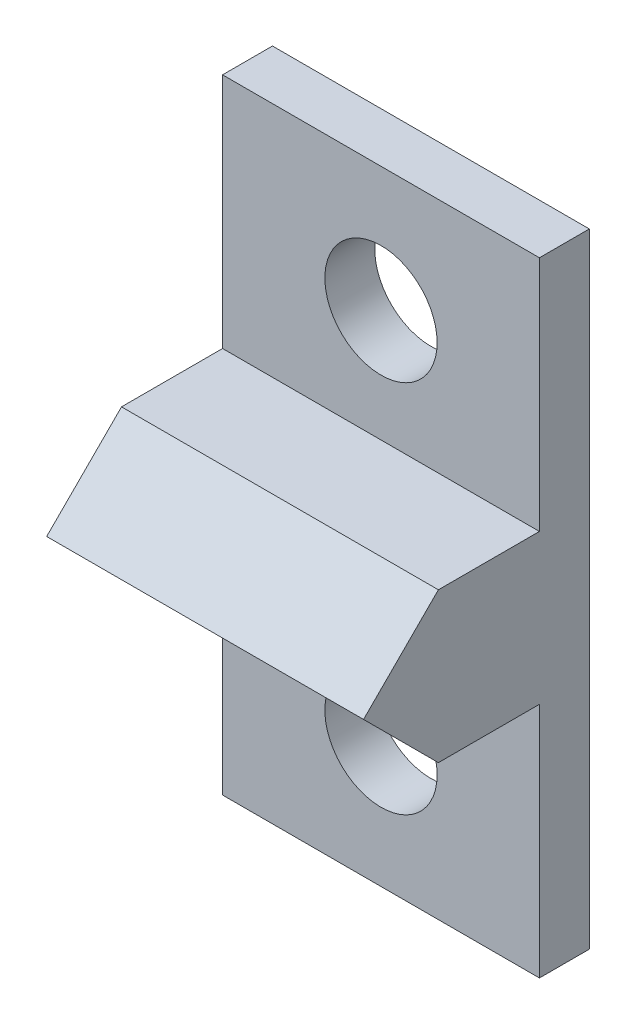
ISO-10303-21;
HEADER;
FILE_DESCRIPTION(('STEP AP214'),'2;1');
FILE_NAME('part.step','',(''),(''),'','','');
FILE_SCHEMA(('AUTOMOTIVE_DESIGN { 1 0 10303 214 1 1 1 1 }'));
ENDSEC;
DATA;
#1=APPLICATION_CONTEXT('core data for automotive mechanical design processes');
#2=APPLICATION_PROTOCOL_DEFINITION('international standard','automotive_design',2000,#1);
#3=PRODUCT_CONTEXT('',#1,'mechanical');
#4=PRODUCT('Part','Part','',(#3));
#5=PRODUCT_RELATED_PRODUCT_CATEGORY('part','',(#4));
#6=PRODUCT_DEFINITION_FORMATION('','',#4);
#7=PRODUCT_DEFINITION_CONTEXT('part definition',#1,'design');
#8=PRODUCT_DEFINITION('design','',#6,#7);
#9=PRODUCT_DEFINITION_SHAPE('','',#8);
#10=(LENGTH_UNIT() NAMED_UNIT(*) SI_UNIT(.MILLI.,.METRE.));
#11=(NAMED_UNIT(*) PLANE_ANGLE_UNIT() SI_UNIT($,.RADIAN.));
#12=(NAMED_UNIT(*) SI_UNIT($,.STERADIAN.) SOLID_ANGLE_UNIT());
#13=UNCERTAINTY_MEASURE_WITH_UNIT(LENGTH_MEASURE(1.E-05),#10,'distance_accuracy_value','');
#14=(GEOMETRIC_REPRESENTATION_CONTEXT(3) GLOBAL_UNCERTAINTY_ASSIGNED_CONTEXT((#13)) GLOBAL_UNIT_ASSIGNED_CONTEXT((#10,
#11,#12)) REPRESENTATION_CONTEXT('',''));
#15=CARTESIAN_POINT('',(0.,0.,0.));
#16=DIRECTION('',(0.,0.,1.));
#17=DIRECTION('',(1.,0.,0.));
#18=AXIS2_PLACEMENT_3D('',#15,#16,#17);
#19=CARTESIAN_POINT('',(0.,0.,2.));
#20=DIRECTION('',(0.,0.,1.));
#21=DIRECTION('',(1.,0.,0.));
#22=AXIS2_PLACEMENT_3D('',#19,#20,#21);
#23=PLANE('',#22);
#24=DIRECTION('',(-1.,0.,0.));
#25=VECTOR('',#24,1.);
#26=CARTESIAN_POINT('',(-6.35,15.5,2.));
#27=LINE('',#26,#25);
#28=CARTESIAN_POINT('',(6.35,15.5,2.));
#29=VERTEX_POINT('',#28);
#30=CARTESIAN_POINT('',(-6.35,15.5,2.));
#31=VERTEX_POINT('',#30);
#32=EDGE_CURVE('E148',#29,#31,#27,.T.);
#33=ORIENTED_EDGE('',*,*,#32,.F.);
#34=DIRECTION('',(0.,1.,0.));
#35=VECTOR('',#34,1.);
#36=CARTESIAN_POINT('',(6.35,0.,2.));
#37=LINE('',#36,#35);
#38=CARTESIAN_POINT('',(6.35,25.,2.));
#39=VERTEX_POINT('',#38);
#40=EDGE_CURVE('E144',#29,#39,#37,.T.);
#41=ORIENTED_EDGE('',*,*,#40,.T.);
#42=DIRECTION('',(1.,0.,0.));
#43=VECTOR('',#42,1.);
#44=CARTESIAN_POINT('',(0.,25.,2.));
#45=LINE('',#44,#43);
#46=CARTESIAN_POINT('',(-6.35,25.,2.));
#47=VERTEX_POINT('',#46);
#48=EDGE_CURVE('E143',#47,#39,#45,.T.);
#49=ORIENTED_EDGE('',*,*,#48,.F.);
#50=DIRECTION('',(0.,1.,0.));
#51=VECTOR('',#50,1.);
#52=CARTESIAN_POINT('',(-6.35,0.,2.));
#53=LINE('',#52,#51);
#54=EDGE_CURVE('E178',#31,#47,#53,.T.);
#55=ORIENTED_EDGE('',*,*,#54,.F.);
#56=EDGE_LOOP('',(#33,#41,#49,#55));
#57=FACE_BOUND('',#56,.T.);
#58=CARTESIAN_POINT('',(0.,20.,2.));
#59=DIRECTION('',(0.,0.,1.));
#60=DIRECTION('',(1.,0.,0.));
#61=AXIS2_PLACEMENT_3D('',#58,#59,#60);
#62=CIRCLE('',#61,2.25);
#63=CARTESIAN_POINT('',(2.25,20.,2.));
#64=VERTEX_POINT('',#63);
#65=EDGE_CURVE('E168',#64,#64,#62,.T.);
#66=ORIENTED_EDGE('',*,*,#65,.F.);
#67=EDGE_LOOP('',(#66));
#68=FACE_BOUND('',#67,.T.);
#69=ADVANCED_FACE('F47',(#57,#68),#23,.T.);
#70=CARTESIAN_POINT('',(0.,0.,2.));
#71=DIRECTION('',(0.,1.,0.));
#72=DIRECTION('',(0.,0.,1.));
#73=AXIS2_PLACEMENT_3D('',#70,#71,#72);
#74=PLANE('',#73);
#75=DIRECTION('',(1.,0.,0.));
#76=VECTOR('',#75,1.);
#77=CARTESIAN_POINT('',(0.,0.,0.));
#78=LINE('',#77,#76);
#79=CARTESIAN_POINT('',(-6.35,0.,0.));
#80=VERTEX_POINT('',#79);
#81=CARTESIAN_POINT('',(6.35,0.,0.));
#82=VERTEX_POINT('',#81);
#83=EDGE_CURVE('E190',#80,#82,#78,.T.);
#84=ORIENTED_EDGE('',*,*,#83,.T.);
#85=DIRECTION('',(0.,0.,-1.));
#86=VECTOR('',#85,1.);
#87=CARTESIAN_POINT('',(6.35,0.,2.));
#88=LINE('',#87,#86);
#89=CARTESIAN_POINT('',(6.35,0.,2.));
#90=VERTEX_POINT('',#89);
#91=EDGE_CURVE('E213',#90,#82,#88,.T.);
#92=ORIENTED_EDGE('',*,*,#91,.F.);
#93=DIRECTION('',(1.,0.,0.));
#94=VECTOR('',#93,1.);
#95=CARTESIAN_POINT('',(0.,0.,2.));
#96=LINE('',#95,#94);
#97=CARTESIAN_POINT('',(-6.35,0.,2.));
#98=VERTEX_POINT('',#97);
#99=EDGE_CURVE('E140',#98,#90,#96,.T.);
#100=ORIENTED_EDGE('',*,*,#99,.F.);
#101=DIRECTION('',(0.,0.,-1.));
#102=VECTOR('',#101,1.);
#103=CARTESIAN_POINT('',(-6.35,0.,2.));
#104=LINE('',#103,#102);
#105=EDGE_CURVE('E182',#98,#80,#104,.T.);
#106=ORIENTED_EDGE('',*,*,#105,.T.);
#107=EDGE_LOOP('',(#84,#92,#100,#106));
#108=FACE_BOUND('',#107,.T.);
#109=ADVANCED_FACE('F253',(#108),#74,.F.);
#110=CARTESIAN_POINT('',(6.35,0.,2.));
#111=DIRECTION('',(-1.,0.,0.));
#112=DIRECTION('',(0.,0.,1.));
#113=AXIS2_PLACEMENT_3D('',#110,#111,#112);
#114=PLANE('',#113);
#115=DIRECTION('',(0.,0.707106781186546,-0.707106781186549));
#116=VECTOR('',#115,1.);
#117=CARTESIAN_POINT('',(6.35,12.5,9.05));
#118=LINE('',#117,#116);
#119=CARTESIAN_POINT('',(6.35,15.5,6.04999999999998));
#120=VERTEX_POINT('',#119);
#121=CARTESIAN_POINT('',(6.35,12.5,9.05));
#122=VERTEX_POINT('',#121);
#123=EDGE_CURVE('E216',#120,#122,#118,.F.);
#124=ORIENTED_EDGE('',*,*,#123,.T.);
#125=DIRECTION('',(0.,0.707106781186546,0.707106781186549));
#126=VECTOR('',#125,1.);
#127=CARTESIAN_POINT('',(6.35,12.5,9.05));
#128=LINE('',#127,#126);
#129=CARTESIAN_POINT('',(6.35,9.5,6.04999999999999));
#130=VERTEX_POINT('',#129);
#131=EDGE_CURVE('E123',#122,#130,#128,.F.);
#132=ORIENTED_EDGE('',*,*,#131,.T.);
#133=DIRECTION('',(0.,0.,-1.));
#134=VECTOR('',#133,1.);
#135=CARTESIAN_POINT('',(6.35,9.5,9.05));
#136=LINE('',#135,#134);
#137=CARTESIAN_POINT('',(6.35,9.5,2.));
#138=VERTEX_POINT('',#137);
#139=EDGE_CURVE('E116',#130,#138,#136,.T.);
#140=ORIENTED_EDGE('',*,*,#139,.T.);
#141=EDGE_CURVE('E120',#90,#138,#37,.T.);
#142=ORIENTED_EDGE('',*,*,#141,.F.);
#143=ORIENTED_EDGE('',*,*,#91,.T.);
#144=DIRECTION('',(0.,1.,0.));
#145=VECTOR('',#144,1.);
#146=CARTESIAN_POINT('',(6.35,0.,0.));
#147=LINE('',#146,#145);
#148=CARTESIAN_POINT('',(6.35,25.,0.));
#149=VERTEX_POINT('',#148);
#150=EDGE_CURVE('E194',#82,#149,#147,.T.);
#151=ORIENTED_EDGE('',*,*,#150,.T.);
#152=DIRECTION('',(0.,0.,-1.));
#153=VECTOR('',#152,1.);
#154=CARTESIAN_POINT('',(6.35,25.,2.));
#155=LINE('',#154,#153);
#156=EDGE_CURVE('E210',#39,#149,#155,.T.);
#157=ORIENTED_EDGE('',*,*,#156,.F.);
#158=ORIENTED_EDGE('',*,*,#40,.F.);
#159=DIRECTION('',(0.,0.,-1.));
#160=VECTOR('',#159,1.);
#161=CARTESIAN_POINT('',(6.35,15.5,9.05));
#162=LINE('',#161,#160);
#163=EDGE_CURVE('E130',#120,#29,#162,.T.);
#164=ORIENTED_EDGE('',*,*,#163,.F.);
#165=EDGE_LOOP('',(#124,#132,#140,#142,#143,#151,#157,#158,#164));
#166=FACE_BOUND('',#165,.T.);
#167=ADVANCED_FACE('F118',(#166),#114,.F.);
#168=CARTESIAN_POINT('',(0.,25.,2.));
#169=DIRECTION('',(0.,1.,0.));
#170=DIRECTION('',(0.,0.,1.));
#171=AXIS2_PLACEMENT_3D('',#168,#169,#170);
#172=PLANE('',#171);
#173=DIRECTION('',(1.,0.,0.));
#174=VECTOR('',#173,1.);
#175=CARTESIAN_POINT('',(0.,25.,0.));
#176=LINE('',#175,#174);
#177=CARTESIAN_POINT('',(-6.35,25.,0.));
#178=VERTEX_POINT('',#177);
#179=EDGE_CURVE('E198',#178,#149,#176,.T.);
#180=ORIENTED_EDGE('',*,*,#179,.F.);
#181=DIRECTION('',(0.,0.,-1.));
#182=VECTOR('',#181,1.);
#183=CARTESIAN_POINT('',(-6.35,25.,2.));
#184=LINE('',#183,#182);
#185=EDGE_CURVE('E207',#47,#178,#184,.T.);
#186=ORIENTED_EDGE('',*,*,#185,.F.);
#187=ORIENTED_EDGE('',*,*,#48,.T.);
#188=ORIENTED_EDGE('',*,*,#156,.T.);
#189=EDGE_LOOP('',(#180,#186,#187,#188));
#190=FACE_BOUND('',#189,.T.);
#191=ADVANCED_FACE('F240',(#190),#172,.T.);
#192=CARTESIAN_POINT('',(0.,20.,2.));
#193=DIRECTION('',(0.,0.,-1.));
#194=DIRECTION('',(-1.,0.,0.));
#195=AXIS2_PLACEMENT_3D('',#192,#193,#194);
#196=CYLINDRICAL_SURFACE('',#195,2.25);
#197=ORIENTED_EDGE('',*,*,#65,.T.);
#198=EDGE_LOOP('',(#197));
#199=FACE_BOUND('',#198,.T.);
#200=CARTESIAN_POINT('',(0.,20.,0.));
#201=DIRECTION('',(0.,0.,1.));
#202=DIRECTION('',(1.,0.,0.));
#203=AXIS2_PLACEMENT_3D('',#200,#201,#202);
#204=CIRCLE('',#203,2.25);
#205=CARTESIAN_POINT('',(2.25,20.,0.));
#206=VERTEX_POINT('',#205);
#207=EDGE_CURVE('E186',#206,#206,#204,.T.);
#208=ORIENTED_EDGE('',*,*,#207,.F.);
#209=EDGE_LOOP('',(#208));
#210=FACE_BOUND('',#209,.T.);
#211=ADVANCED_FACE('F289',(#199,#210),#196,.F.);
#212=CARTESIAN_POINT('',(0.,5.,2.));
#213=DIRECTION('',(0.,0.,-1.));
#214=DIRECTION('',(-1.,0.,0.));
#215=AXIS2_PLACEMENT_3D('',#212,#213,#214);
#216=CYLINDRICAL_SURFACE('',#215,2.25);
#217=CARTESIAN_POINT('',(0.,5.,2.));
#218=DIRECTION('',(0.,0.,1.));
#219=DIRECTION('',(1.,0.,0.));
#220=AXIS2_PLACEMENT_3D('',#217,#218,#219);
#221=CIRCLE('',#220,2.25);
#222=CARTESIAN_POINT('',(2.25,5.,2.));
#223=VERTEX_POINT('',#222);
#224=EDGE_CURVE('E164',#223,#223,#221,.T.);
#225=ORIENTED_EDGE('',*,*,#224,.T.);
#226=EDGE_LOOP('',(#225));
#227=FACE_BOUND('',#226,.T.);
#228=CARTESIAN_POINT('',(0.,5.,0.));
#229=DIRECTION('',(0.,0.,1.));
#230=DIRECTION('',(1.,0.,0.));
#231=AXIS2_PLACEMENT_3D('',#228,#229,#230);
#232=CIRCLE('',#231,2.25);
#233=CARTESIAN_POINT('',(2.25,5.,0.));
#234=VERTEX_POINT('',#233);
#235=EDGE_CURVE('E163',#234,#234,#232,.T.);
#236=ORIENTED_EDGE('',*,*,#235,.F.);
#237=EDGE_LOOP('',(#236));
#238=FACE_BOUND('',#237,.T.);
#239=ADVANCED_FACE('F287',(#227,#238),#216,.F.);
#240=CARTESIAN_POINT('',(-6.35,0.,2.));
#241=DIRECTION('',(-1.,0.,0.));
#242=DIRECTION('',(0.,0.,1.));
#243=AXIS2_PLACEMENT_3D('',#240,#241,#242);
#244=PLANE('',#243);
#245=DIRECTION('',(0.,0.,-1.));
#246=VECTOR('',#245,1.);
#247=CARTESIAN_POINT('',(-6.35,9.5,9.05));
#248=LINE('',#247,#246);
#249=CARTESIAN_POINT('',(-6.35,9.5,6.04999999999999));
#250=VERTEX_POINT('',#249);
#251=CARTESIAN_POINT('',(-6.35,9.5,2.));
#252=VERTEX_POINT('',#251);
#253=EDGE_CURVE('E129',#250,#252,#248,.T.);
#254=ORIENTED_EDGE('',*,*,#253,.F.);
#255=DIRECTION('',(0.,-0.707106781186546,-0.707106781186549));
#256=VECTOR('',#255,1.);
#257=CARTESIAN_POINT('',(-6.35,2.72500000000002,-0.725000000000014));
#258=LINE('',#257,#256);
#259=CARTESIAN_POINT('',(-6.35,12.5,9.05));
#260=VERTEX_POINT('',#259);
#261=EDGE_CURVE('E58',#250,#260,#258,.F.);
#262=ORIENTED_EDGE('',*,*,#261,.T.);
#263=DIRECTION('',(0.,-0.707106781186546,0.707106781186549));
#264=VECTOR('',#263,1.);
#265=CARTESIAN_POINT('',(-6.35,9.77500000000002,11.775));
#266=LINE('',#265,#264);
#267=CARTESIAN_POINT('',(-6.35,15.5,6.04999999999998));
#268=VERTEX_POINT('',#267);
#269=EDGE_CURVE('E65',#260,#268,#266,.F.);
#270=ORIENTED_EDGE('',*,*,#269,.T.);
#271=DIRECTION('',(0.,0.,-1.));
#272=VECTOR('',#271,1.);
#273=CARTESIAN_POINT('',(-6.35,15.5,9.05));
#274=LINE('',#273,#272);
#275=EDGE_CURVE('E153',#268,#31,#274,.T.);
#276=ORIENTED_EDGE('',*,*,#275,.T.);
#277=ORIENTED_EDGE('',*,*,#54,.T.);
#278=ORIENTED_EDGE('',*,*,#185,.T.);
#279=DIRECTION('',(0.,1.,0.));
#280=VECTOR('',#279,1.);
#281=CARTESIAN_POINT('',(-6.35,0.,0.));
#282=LINE('',#281,#280);
#283=EDGE_CURVE('E169',#80,#178,#282,.T.);
#284=ORIENTED_EDGE('',*,*,#283,.F.);
#285=ORIENTED_EDGE('',*,*,#105,.F.);
#286=EDGE_CURVE('E179',#98,#252,#53,.T.);
#287=ORIENTED_EDGE('',*,*,#286,.T.);
#288=EDGE_LOOP('',(#254,#262,#270,#276,#277,#278,#284,#285,#287));
#289=FACE_BOUND('',#288,.T.);
#290=ADVANCED_FACE('F242',(#289),#244,.T.);
#291=DIRECTION('',(1.,0.,0.));
#292=VECTOR('',#291,1.);
#293=CARTESIAN_POINT('',(-6.35,9.5,2.));
#294=LINE('',#293,#292);
#295=EDGE_CURVE('E137',#252,#138,#294,.T.);
#296=ORIENTED_EDGE('',*,*,#295,.F.);
#297=ORIENTED_EDGE('',*,*,#286,.F.);
#298=ORIENTED_EDGE('',*,*,#99,.T.);
#299=ORIENTED_EDGE('',*,*,#141,.T.);
#300=EDGE_LOOP('',(#296,#297,#298,#299));
#301=FACE_BOUND('',#300,.T.);
#302=ORIENTED_EDGE('',*,*,#224,.F.);
#303=EDGE_LOOP('',(#302));
#304=FACE_BOUND('',#303,.T.);
#305=ADVANCED_FACE('F134',(#301,#304),#23,.T.);
#306=CARTESIAN_POINT('',(0.,0.,0.));
#307=DIRECTION('',(0.,0.,1.));
#308=DIRECTION('',(1.,0.,0.));
#309=AXIS2_PLACEMENT_3D('',#306,#307,#308);
#310=PLANE('',#309);
#311=ORIENTED_EDGE('',*,*,#235,.T.);
#312=EDGE_LOOP('',(#311));
#313=FACE_BOUND('',#312,.T.);
#314=ORIENTED_EDGE('',*,*,#207,.T.);
#315=EDGE_LOOP('',(#314));
#316=FACE_BOUND('',#315,.T.);
#317=ORIENTED_EDGE('',*,*,#83,.F.);
#318=ORIENTED_EDGE('',*,*,#283,.T.);
#319=ORIENTED_EDGE('',*,*,#179,.T.);
#320=ORIENTED_EDGE('',*,*,#150,.F.);
#321=EDGE_LOOP('',(#317,#318,#319,#320));
#322=FACE_BOUND('',#321,.T.);
#323=ADVANCED_FACE('F255',(#313,#316,#322),#310,.F.);
#324=CARTESIAN_POINT('',(-6.35,9.5,9.05));
#325=DIRECTION('',(0.,1.,0.));
#326=DIRECTION('',(0.,0.,1.));
#327=AXIS2_PLACEMENT_3D('',#324,#325,#326);
#328=PLANE('',#327);
#329=ORIENTED_EDGE('',*,*,#139,.F.);
#330=DIRECTION('',(-1.,0.,0.));
#331=VECTOR('',#330,1.);
#332=CARTESIAN_POINT('',(-6.35,9.5,6.04999999999999));
#333=LINE('',#332,#331);
#334=EDGE_CURVE('E221',#130,#250,#333,.T.);
#335=ORIENTED_EDGE('',*,*,#334,.T.);
#336=ORIENTED_EDGE('',*,*,#253,.T.);
#337=ORIENTED_EDGE('',*,*,#295,.T.);
#338=EDGE_LOOP('',(#329,#335,#336,#337));
#339=FACE_BOUND('',#338,.T.);
#340=ADVANCED_FACE('F146',(#339),#328,.F.);
#341=CARTESIAN_POINT('',(-6.35,15.5,9.05));
#342=DIRECTION('',(0.,-1.,0.));
#343=DIRECTION('',(0.,0.,-1.));
#344=AXIS2_PLACEMENT_3D('',#341,#342,#343);
#345=PLANE('',#344);
#346=ORIENTED_EDGE('',*,*,#275,.F.);
#347=DIRECTION('',(1.,0.,0.));
#348=VECTOR('',#347,1.);
#349=CARTESIAN_POINT('',(-6.35,15.5,6.04999999999998));
#350=LINE('',#349,#348);
#351=EDGE_CURVE('E11',#268,#120,#350,.T.);
#352=ORIENTED_EDGE('',*,*,#351,.T.);
#353=ORIENTED_EDGE('',*,*,#163,.T.);
#354=ORIENTED_EDGE('',*,*,#32,.T.);
#355=EDGE_LOOP('',(#346,#352,#353,#354));
#356=FACE_BOUND('',#355,.T.);
#357=ADVANCED_FACE('F244',(#356),#345,.F.);
#358=CARTESIAN_POINT('',(0.,12.5,9.05));
#359=DIRECTION('',(0.,-0.707106781186549,-0.707106781186546));
#360=DIRECTION('',(-1.,0.,0.));
#361=AXIS2_PLACEMENT_3D('',#358,#359,#360);
#362=PLANE('',#361);
#363=ORIENTED_EDGE('',*,*,#351,.F.);
#364=ORIENTED_EDGE('',*,*,#269,.F.);
#365=DIRECTION('',(-1.,0.,0.));
#366=VECTOR('',#365,1.);
#367=CARTESIAN_POINT('',(0.,12.5,9.05));
#368=LINE('',#367,#366);
#369=EDGE_CURVE('E52',#122,#260,#368,.T.);
#370=ORIENTED_EDGE('',*,*,#369,.F.);
#371=ORIENTED_EDGE('',*,*,#123,.F.);
#372=EDGE_LOOP('',(#363,#364,#370,#371));
#373=FACE_BOUND('',#372,.T.);
#374=ADVANCED_FACE('F50',(#373),#362,.F.);
#375=CARTESIAN_POINT('',(0.,12.5,9.05));
#376=DIRECTION('',(0.,0.707106781186549,-0.707106781186546));
#377=DIRECTION('',(1.,0.,0.));
#378=AXIS2_PLACEMENT_3D('',#375,#376,#377);
#379=PLANE('',#378);
#380=ORIENTED_EDGE('',*,*,#261,.F.);
#381=ORIENTED_EDGE('',*,*,#334,.F.);
#382=ORIENTED_EDGE('',*,*,#131,.F.);
#383=ORIENTED_EDGE('',*,*,#369,.T.);
#384=EDGE_LOOP('',(#380,#381,#382,#383));
#385=FACE_BOUND('',#384,.T.);
#386=ADVANCED_FACE('F250',(#385),#379,.F.);
#387=CLOSED_SHELL('',(#69,#109,#167,#191,#211,#239,#290,#305,#323,#340,#357,#374,#386));
#388=MANIFOLD_SOLID_BREP('B2',#387);
#389=ADVANCED_BREP_SHAPE_REPRESENTATION('',(#18,#388),#14);
#390=SHAPE_DEFINITION_REPRESENTATION(#9,#389);
ENDSEC;
END-ISO-10303-21;
